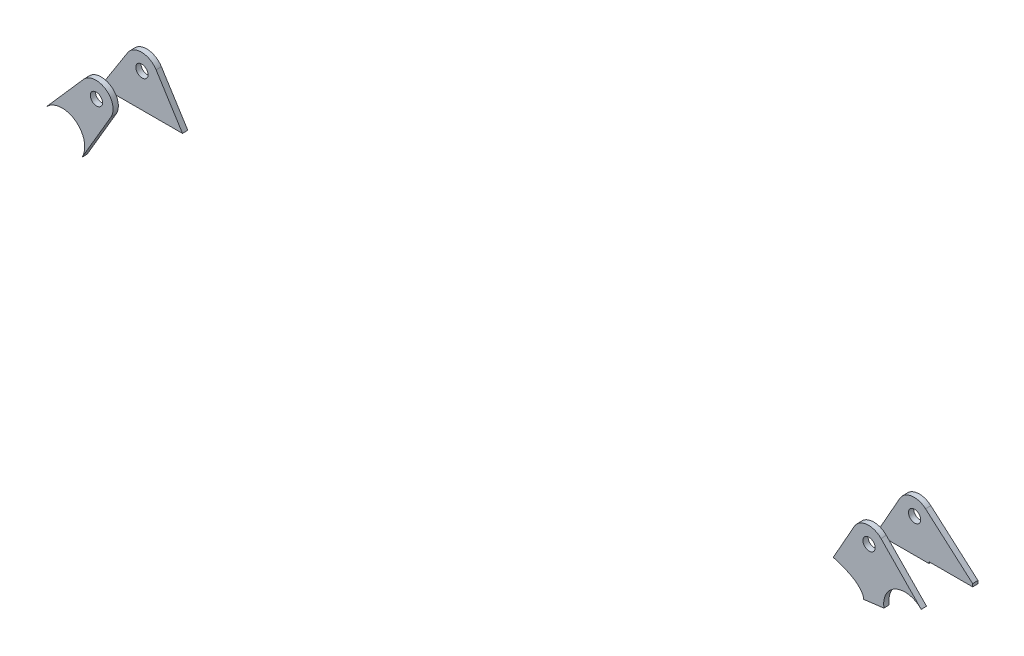
ISO-10303-21;
HEADER;
FILE_DESCRIPTION(('STEP AP214'),'2;1');
FILE_NAME('part.step','',(''),(''),'','','');
FILE_SCHEMA(('AUTOMOTIVE_DESIGN { 1 0 10303 214 1 1 1 1 }'));
ENDSEC;
DATA;
#1=APPLICATION_CONTEXT('core data for automotive mechanical design processes');
#2=APPLICATION_PROTOCOL_DEFINITION('international standard','automotive_design',2000,#1);
#3=PRODUCT_CONTEXT('',#1,'mechanical');
#4=PRODUCT('Part','Part','',(#3));
#5=PRODUCT_RELATED_PRODUCT_CATEGORY('part','',(#4));
#6=PRODUCT_DEFINITION_FORMATION('','',#4);
#7=PRODUCT_DEFINITION_CONTEXT('part definition',#1,'design');
#8=PRODUCT_DEFINITION('design','',#6,#7);
#9=PRODUCT_DEFINITION_SHAPE('','',#8);
#10=(LENGTH_UNIT() NAMED_UNIT(*) SI_UNIT(.MILLI.,.METRE.));
#11=(NAMED_UNIT(*) PLANE_ANGLE_UNIT() SI_UNIT($,.RADIAN.));
#12=(NAMED_UNIT(*) SI_UNIT($,.STERADIAN.) SOLID_ANGLE_UNIT());
#13=UNCERTAINTY_MEASURE_WITH_UNIT(LENGTH_MEASURE(1.E-05),#10,'distance_accuracy_value','');
#14=(GEOMETRIC_REPRESENTATION_CONTEXT(3) GLOBAL_UNCERTAINTY_ASSIGNED_CONTEXT((#13)) GLOBAL_UNIT_ASSIGNED_CONTEXT((#10,
#11,#12)) REPRESENTATION_CONTEXT('',''));
#15=CARTESIAN_POINT('',(0.,0.,0.));
#16=DIRECTION('',(0.,0.,1.));
#17=DIRECTION('',(1.,0.,0.));
#18=AXIS2_PLACEMENT_3D('',#15,#16,#17);
#19=CARTESIAN_POINT('',(-91.2738670795546,-55.8010311842299,94.258605063489));
#20=DIRECTION('',(0.866024919322855,0.499773154302078,0.0150875230171749));
#21=DIRECTION('',(-0.499830046534065,0.866123504231212,0.));
#22=AXIS2_PLACEMENT_3D('',#19,#20,#21);
#23=PLANE('',#22);
#24=DIRECTION('',(0.499999720295997,-0.865564787044811,-0.0282467543621517));
#25=VECTOR('',#24,1.);
#26=CARTESIAN_POINT('',(-91.2770403021915,-55.7050127328614,91.2601437267939));
#27=LINE('',#26,#25);
#28=CARTESIAN_POINT('',(-251.786513505118,222.157838688974,100.327892124088));
#29=VERTEX_POINT('',#28);
#30=CARTESIAN_POINT('',(-237.537473877372,197.49089098812,99.5229134292533));
#31=VERTEX_POINT('',#30);
#32=EDGE_CURVE('E118',#29,#31,#27,.T.);
#33=ORIENTED_EDGE('',*,*,#32,.F.);
#34=DIRECTION('',(-0.00105774087897386,0.0320061504561618,-0.999487112231674));
#35=VECTOR('',#34,1.);
#36=CARTESIAN_POINT('',(-251.783340282481,222.061820237606,103.326353460783));
#37=LINE('',#36,#35);
#38=CARTESIAN_POINT('',(-251.783340282481,222.061820237606,103.326353460783));
#39=VERTEX_POINT('',#38);
#40=EDGE_CURVE('E12',#39,#29,#37,.T.);
#41=ORIENTED_EDGE('',*,*,#40,.F.);
#42=DIRECTION('',(0.499999720295997,-0.865564787044811,-0.0282467543621517));
#43=VECTOR('',#42,1.);
#44=CARTESIAN_POINT('',(-91.2738670795546,-55.8010311842299,94.258605063489));
#45=LINE('',#44,#43);
#46=CARTESIAN_POINT('',(-237.534300654735,197.394872536751,102.521374765948));
#47=VERTEX_POINT('',#46);
#48=EDGE_CURVE('E102',#39,#47,#45,.T.);
#49=ORIENTED_EDGE('',*,*,#48,.T.);
#50=DIRECTION('',(-0.00105774087897386,0.0320061504561618,-0.999487112231674));
#51=VECTOR('',#50,1.);
#52=CARTESIAN_POINT('',(-237.534300654735,197.394872536751,102.521374765948));
#53=LINE('',#52,#51);
#54=EDGE_CURVE('E64',#47,#31,#53,.T.);
#55=ORIENTED_EDGE('',*,*,#54,.T.);
#56=EDGE_LOOP('',(#33,#41,#49,#55));
#57=FACE_BOUND('',#56,.T.);
#58=ADVANCED_FACE('F47',(#57),#23,.T.);
#59=CARTESIAN_POINT('',(-260.010577016049,217.313975271736,103.18302199212));
#60=DIRECTION('',(-0.00105774087897386,0.0320061504561618,-0.999487112231674));
#61=DIRECTION('',(0.,0.999487671353113,0.0320061683606697));
#62=AXIS2_PLACEMENT_3D('',#59,#60,#61);
#63=CYLINDRICAL_SURFACE('',#62,9.50000000000002);
#64=CARTESIAN_POINT('',(-260.013750238686,217.409993723105,100.184560655425));
#65=DIRECTION('',(0.00105774087897385,-0.0320061504561618,0.999487112231674));
#66=DIRECTION('',(0.,-0.999487671353113,-0.0320061683606697));
#67=AXIS2_PLACEMENT_3D('',#64,#65,#66);
#68=CIRCLE('',#67,9.50000000000002);
#69=CARTESIAN_POINT('',(-267.980359347288,222.582308660358,100.358622427788));
#70=VERTEX_POINT('',#69);
#71=EDGE_CURVE('E107',#29,#70,#68,.T.);
#72=ORIENTED_EDGE('',*,*,#71,.T.);
#73=DIRECTION('',(-0.00105774087897386,0.0320061504561618,-0.999487112231674));
#74=VECTOR('',#73,1.);
#75=CARTESIAN_POINT('',(-267.977186124651,222.486290208989,103.357083764483));
#76=LINE('',#75,#74);
#77=CARTESIAN_POINT('',(-267.977186124651,222.486290208989,103.357083764483));
#78=VERTEX_POINT('',#77);
#79=EDGE_CURVE('E56',#78,#70,#76,.T.);
#80=ORIENTED_EDGE('',*,*,#79,.F.);
#81=CARTESIAN_POINT('',(-260.010577016049,217.313975271736,103.18302199212));
#82=DIRECTION('',(0.00105774087897385,-0.0320061504561618,0.999487112231674));
#83=DIRECTION('',(0.,-0.999487671353113,-0.0320061683606697));
#84=AXIS2_PLACEMENT_3D('',#81,#82,#83);
#85=CIRCLE('',#84,9.50000000000002);
#86=EDGE_CURVE('E98',#39,#78,#85,.T.);
#87=ORIENTED_EDGE('',*,*,#86,.F.);
#88=ORIENTED_EDGE('',*,*,#40,.T.);
#89=EDGE_LOOP('',(#72,#80,#87,#88));
#90=FACE_BOUND('',#89,.T.);
#91=ADVANCED_FACE('F105',(#90),#63,.T.);
#92=CARTESIAN_POINT('',(-291.518754077939,186.264808466527,102.222092325642));
#93=DIRECTION('',(0.838590432484473,-0.544454203921399,-0.0183222918277194));
#94=DIRECTION('',(0.544545615311927,0.838731228013215,0.));
#95=AXIS2_PLACEMENT_3D('',#92,#93,#94);
#96=PLANE('',#95);
#97=DIRECTION('',(-0.544761386048734,-0.838179709946079,-0.026264160084979));
#98=VECTOR('',#97,1.);
#99=CARTESIAN_POINT('',(-291.521927300576,186.360826917896,99.2236309889469));
#100=LINE('',#99,#98);
#101=CARTESIAN_POINT('',(-284.286956001345,197.492684462062,99.5724450739382));
#102=VERTEX_POINT('',#101);
#103=EDGE_CURVE('E115',#70,#102,#100,.T.);
#104=ORIENTED_EDGE('',*,*,#103,.T.);
#105=DIRECTION('',(-0.00105774087897386,0.0320061504561618,-0.999487112231674));
#106=VECTOR('',#105,1.);
#107=CARTESIAN_POINT('',(-284.283782778708,197.396666010694,102.570906410633));
#108=LINE('',#107,#106);
#109=CARTESIAN_POINT('',(-284.283782778708,197.396666010694,102.570906410633));
#110=VERTEX_POINT('',#109);
#111=EDGE_CURVE('E78',#110,#102,#108,.T.);
#112=ORIENTED_EDGE('',*,*,#111,.F.);
#113=DIRECTION('',(-0.544761386048734,-0.838179709946079,-0.026264160084979));
#114=VECTOR('',#113,1.);
#115=CARTESIAN_POINT('',(-291.518754077939,186.264808466527,102.222092325642));
#116=LINE('',#115,#114);
#117=EDGE_CURVE('E90',#78,#110,#116,.T.);
#118=ORIENTED_EDGE('',*,*,#117,.F.);
#119=ORIENTED_EDGE('',*,*,#79,.T.);
#120=EDGE_LOOP('',(#104,#112,#118,#119));
#121=FACE_BOUND('',#120,.T.);
#122=ADVANCED_FACE('F92',(#121),#96,.F.);
#123=CARTESIAN_POINT('',(-260.010577016049,217.313975271736,103.18302199212));
#124=DIRECTION('',(-0.00105774087897386,0.0320061504561618,-0.999487112231674));
#125=DIRECTION('',(0.,0.999487671353113,0.0320061683606697));
#126=AXIS2_PLACEMENT_3D('',#123,#124,#125);
#127=CYLINDRICAL_SURFACE('',#126,3.5);
#128=CARTESIAN_POINT('',(-260.010577016049,217.313975271736,103.18302199212));
#129=DIRECTION('',(0.00105774087897385,-0.0320061504561618,0.999487112231674));
#130=DIRECTION('',(0.,-0.999487671353113,-0.0320061683606697));
#131=AXIS2_PLACEMENT_3D('',#128,#129,#130);
#132=CIRCLE('',#131,3.5);
#133=CARTESIAN_POINT('',(-260.010577016049,213.815768422,103.071000402857));
#134=VERTEX_POINT('',#133);
#135=EDGE_CURVE('E114',#134,#134,#132,.T.);
#136=ORIENTED_EDGE('',*,*,#135,.T.);
#137=EDGE_LOOP('',(#136));
#138=FACE_BOUND('',#137,.T.);
#139=CARTESIAN_POINT('',(-260.013750238686,217.409993723105,100.184560655425));
#140=DIRECTION('',(0.00105774087897385,-0.0320061504561618,0.999487112231674));
#141=DIRECTION('',(0.,-0.999487671353113,-0.0320061683606697));
#142=AXIS2_PLACEMENT_3D('',#139,#140,#141);
#143=CIRCLE('',#142,3.5);
#144=CARTESIAN_POINT('',(-260.013750238686,213.911786873369,100.072539066162));
#145=VERTEX_POINT('',#144);
#146=EDGE_CURVE('E120',#145,#145,#143,.T.);
#147=ORIENTED_EDGE('',*,*,#146,.F.);
#148=EDGE_LOOP('',(#147));
#149=FACE_BOUND('',#148,.T.);
#150=ADVANCED_FACE('F49',(#138,#149),#127,.F.);
#151=CARTESIAN_POINT('',(0.115928274146804,197.385755441254,102.269581459075));
#152=DIRECTION('',(-7.22546927104146E-05,-0.999487671190206,-0.0320060918894924));
#153=DIRECTION('',(0.,0.0320060919730401,-0.999487673799239));
#154=AXIS2_PLACEMENT_3D('',#151,#152,#153);
#155=PLANE('',#154);
#156=DIRECTION('',(-0.999999437981588,3.83634823946099E-05,0.00105951156241431));
#157=VECTOR('',#156,1.);
#158=CARTESIAN_POINT('',(0.112755051509882,197.481773892622,99.2711201223803));
#159=LINE('',#158,#157);
#160=EDGE_CURVE('E111',#31,#102,#159,.T.);
#161=ORIENTED_EDGE('',*,*,#160,.F.);
#162=ORIENTED_EDGE('',*,*,#54,.F.);
#163=DIRECTION('',(-0.999999437981588,3.83634823946099E-05,0.00105951156241431));
#164=VECTOR('',#163,1.);
#165=CARTESIAN_POINT('',(0.115928274146804,197.385755441254,102.269581459075));
#166=LINE('',#165,#164);
#167=EDGE_CURVE('E97',#47,#110,#166,.T.);
#168=ORIENTED_EDGE('',*,*,#167,.T.);
#169=ORIENTED_EDGE('',*,*,#111,.T.);
#170=EDGE_LOOP('',(#161,#162,#168,#169));
#171=FACE_BOUND('',#170,.T.);
#172=ADVANCED_FACE('F132',(#171),#155,.T.);
#173=CARTESIAN_POINT('',(0.101437025648791,-3.06938000532834,95.8505072976263));
#174=DIRECTION('',(0.00105774087897385,-0.0320061504561618,0.999487112231674));
#175=DIRECTION('',(0.,-0.999487671353113,-0.0320061683606697));
#176=AXIS2_PLACEMENT_3D('',#173,#174,#175);
#177=PLANE('',#176);
#178=ORIENTED_EDGE('',*,*,#135,.F.);
#179=EDGE_LOOP('',(#178));
#180=FACE_BOUND('',#179,.T.);
#181=ORIENTED_EDGE('',*,*,#48,.F.);
#182=ORIENTED_EDGE('',*,*,#86,.T.);
#183=ORIENTED_EDGE('',*,*,#117,.T.);
#184=ORIENTED_EDGE('',*,*,#167,.F.);
#185=EDGE_LOOP('',(#181,#182,#183,#184));
#186=FACE_BOUND('',#185,.T.);
#187=ADVANCED_FACE('F101',(#180,#186),#177,.T.);
#188=CARTESIAN_POINT('',(0.0982638030118695,-2.97336155395985,92.8520459609312));
#189=DIRECTION('',(0.00105774087897385,-0.0320061504561618,0.999487112231674));
#190=DIRECTION('',(0.,-0.999487671353113,-0.0320061683606697));
#191=AXIS2_PLACEMENT_3D('',#188,#189,#190);
#192=PLANE('',#191);
#193=ORIENTED_EDGE('',*,*,#146,.T.);
#194=EDGE_LOOP('',(#193));
#195=FACE_BOUND('',#194,.T.);
#196=ORIENTED_EDGE('',*,*,#32,.T.);
#197=ORIENTED_EDGE('',*,*,#160,.T.);
#198=ORIENTED_EDGE('',*,*,#103,.F.);
#199=ORIENTED_EDGE('',*,*,#71,.F.);
#200=EDGE_LOOP('',(#196,#197,#198,#199));
#201=FACE_BOUND('',#200,.T.);
#202=ADVANCED_FACE('F131',(#195,#201),#192,.F.);
#203=CLOSED_SHELL('',(#58,#91,#122,#150,#172,#187,#202));
#204=MANIFOLD_SOLID_BREP('B2',#203);
#205=CARTESIAN_POINT('',(212.513005449773,199.961143919961,102.127275672207));
#206=DIRECTION('',(0.99999943730061,-4.72380598829465E-05,-0.00105979574851192));
#207=DIRECTION('',(-0.00105979574969435,0.,-0.999999438416327));
#208=AXIS2_PLACEMENT_3D('',#205,#206,#207);
#209=PLANE('',#208);
#210=CARTESIAN_POINT('',(212.509832227137,200.05716237133,99.1288143355122));
#211=DIRECTION('',(-8.11338142395073E-05,-0.999487670810172,-0.0320060824806945));
#212=VECTOR('',#211,1.);
#213=LINE('',#210,#212);
#214=CARTESIAN_POINT('',(212.509832227137,200.05716237133,99.1288143355122));
#215=VERTEX_POINT('',#214);
#216=CARTESIAN_POINT('',(212.509697306726,198.395077489638,99.0755902414419));
#217=VERTEX_POINT('',#216);
#218=EDGE_CURVE('E303',#215,#217,#213,.T.);
#219=ORIENTED_EDGE('',*,*,#218,.F.);
#220=CARTESIAN_POINT('',(212.513005449774,199.961143919961,102.127275672207));
#221=DIRECTION('',(-0.00105774087897729,0.0320061504561578,-0.999487112231674));
#222=VECTOR('',#221,1.);
#223=LINE('',#220,#222);
#224=CARTESIAN_POINT('',(212.513005449774,199.961143919961,102.127275672207));
#225=VERTEX_POINT('',#224);
#226=EDGE_CURVE('E45',#225,#215,#223,.T.);
#227=ORIENTED_EDGE('',*,*,#226,.F.);
#228=CARTESIAN_POINT('',(212.513005449773,199.961143919961,102.127275672207));
#229=DIRECTION('',(-8.11338142395073E-05,-0.999487670810172,-0.0320060824806945));
#230=VECTOR('',#229,1.);
#231=LINE('',#228,#230);
#232=CARTESIAN_POINT('',(212.512870529363,198.29905903827,102.074051578137));
#233=VERTEX_POINT('',#232);
#234=EDGE_CURVE('E393',#225,#233,#231,.T.);
#235=ORIENTED_EDGE('',*,*,#234,.T.);
#236=CARTESIAN_POINT('',(212.512870529364,198.29905903827,102.074051578137));
#237=DIRECTION('',(-0.00105774087897729,0.0320061504561578,-0.999487112231674));
#238=VECTOR('',#237,1.);
#239=LINE('',#236,#238);
#240=EDGE_CURVE('E220',#233,#217,#239,.T.);
#241=ORIENTED_EDGE('',*,*,#240,.T.);
#242=EDGE_LOOP('',(#219,#227,#235,#241));
#243=FACE_BOUND('',#242,.T.);
#244=ADVANCED_FACE('F201',(#243),#209,.T.);
#245=CARTESIAN_POINT('',(200.398592231556,211.270244285348,102.502242666096));
#246=DIRECTION('',(0.682592365409432,0.730447674082727,0.0226684386733988));
#247=DIRECTION('',(-0.730635419673092,0.682767810839912,0.));
#248=AXIS2_PLACEMENT_3D('',#245,#246,#247);
#249=PLANE('',#248);
#250=DIRECTION('',(0.730798565864075,-0.682218294800214,-0.0226197783123503));
#251=VECTOR('',#250,1.);
#252=CARTESIAN_POINT('',(200.395419008919,211.366262736717,99.503781329401));
#253=LINE('',#252,#251);
#254=CARTESIAN_POINT('',(186.470877203989,224.365162310091,99.9347756737264));
#255=VERTEX_POINT('',#254);
#256=EDGE_CURVE('E308',#255,#215,#253,.T.);
#257=ORIENTED_EDGE('',*,*,#256,.F.);
#258=DIRECTION('',(-0.00105774087897386,0.0320061504561618,-0.999487112231674));
#259=VECTOR('',#258,1.);
#260=CARTESIAN_POINT('',(186.474050426626,224.269143858723,102.933237010421));
#261=LINE('',#260,#259);
#262=CARTESIAN_POINT('',(186.474050426626,224.269143858723,102.933237010421));
#263=VERTEX_POINT('',#262);
#264=EDGE_CURVE('E212',#263,#255,#261,.T.);
#265=ORIENTED_EDGE('',*,*,#264,.F.);
#266=DIRECTION('',(0.730798565864075,-0.682218294800214,-0.0226197783123503));
#267=VECTOR('',#266,1.);
#268=CARTESIAN_POINT('',(200.398592231556,211.270244285348,102.502242666096));
#269=LINE('',#268,#267);
#270=EDGE_CURVE('E408',#263,#225,#269,.T.);
#271=ORIENTED_EDGE('',*,*,#270,.T.);
#272=ORIENTED_EDGE('',*,*,#226,.T.);
#273=EDGE_LOOP('',(#257,#265,#271,#272));
#274=FACE_BOUND('',#273,.T.);
#275=ADVANCED_FACE('F347',(#274),#249,.T.);
#276=CARTESIAN_POINT('',(179.989422955237,217.329890954937,102.717886843024));
#277=DIRECTION('',(-0.00105774087897386,0.0320061504561618,-0.999487112231674));
#278=DIRECTION('',(0.,0.999487671353113,0.0320061683606697));
#279=AXIS2_PLACEMENT_3D('',#276,#277,#278);
#280=CYLINDRICAL_SURFACE('',#279,9.5);
#281=CARTESIAN_POINT('',(179.9862497326,217.425909406305,99.7194255063291));
#282=DIRECTION('',(0.00105774087897385,-0.0320061504561618,0.999487112231674));
#283=DIRECTION('',(0.,-0.999487671353113,-0.0320061683606697));
#284=AXIS2_PLACEMENT_3D('',#281,#282,#283);
#285=CIRCLE('',#284,9.5);
#286=CARTESIAN_POINT('',(171.759012999033,222.17319731829,99.8801526370923));
#287=VERTEX_POINT('',#286);
#288=EDGE_CURVE('E374',#255,#287,#285,.T.);
#289=ORIENTED_EDGE('',*,*,#288,.T.);
#290=DIRECTION('',(-0.00105774087897386,0.0320061504561618,-0.999487112231674));
#291=VECTOR('',#290,1.);
#292=CARTESIAN_POINT('',(171.76218622167,222.077178866922,102.878613973787));
#293=LINE('',#292,#291);
#294=CARTESIAN_POINT('',(171.76218622167,222.077178866922,102.878613973787));
#295=VERTEX_POINT('',#294);
#296=EDGE_CURVE('E396',#295,#287,#293,.T.);
#297=ORIENTED_EDGE('',*,*,#296,.F.);
#298=CARTESIAN_POINT('',(179.989422955237,217.329890954937,102.717886843024));
#299=DIRECTION('',(0.00105774087897385,-0.0320061504561618,0.999487112231674));
#300=DIRECTION('',(0.,-0.999487671353113,-0.0320061683606697));
#301=AXIS2_PLACEMENT_3D('',#298,#299,#300);
#302=CIRCLE('',#301,9.5);
#303=EDGE_CURVE('E406',#263,#295,#302,.T.);
#304=ORIENTED_EDGE('',*,*,#303,.F.);
#305=ORIENTED_EDGE('',*,*,#264,.T.);
#306=EDGE_LOOP('',(#289,#297,#304,#305));
#307=FACE_BOUND('',#306,.T.);
#308=ADVANCED_FACE('F356',(#307),#280,.T.);
#309=CARTESIAN_POINT('',(31.3082782289013,-21.0763809964377,95.2408510777782));
#310=DIRECTION('',(0.866024919322865,-0.499714517051052,-0.0169186453434954));
#311=DIRECTION('',(0.49978605169017,0.866148891666987,0.));
#312=AXIS2_PLACEMENT_3D('',#309,#310,#311);
#313=PLANE('',#312);
#314=DIRECTION('',(-0.49999972029598,-0.865598641277475,-0.0271895553941314));
#315=VECTOR('',#314,1.);
#316=CARTESIAN_POINT('',(31.3051050062644,-20.9803625450692,92.2423897410831));
#317=LINE('',#316,#315);
#318=CARTESIAN_POINT('',(157.488389351472,197.467918618938,99.1041283786298));
#319=VERTEX_POINT('',#318);
#320=EDGE_CURVE('E375',#287,#319,#317,.T.);
#321=ORIENTED_EDGE('',*,*,#320,.T.);
#322=DIRECTION('',(-0.00105774087897386,0.0320061504561618,-0.999487112231674));
#323=VECTOR('',#322,1.);
#324=CARTESIAN_POINT('',(157.491562574109,197.371900167569,102.102589715325));
#325=LINE('',#324,#323);
#326=CARTESIAN_POINT('',(157.491562574109,197.371900167569,102.102589715325));
#327=VERTEX_POINT('',#326);
#328=EDGE_CURVE('E276',#327,#319,#325,.T.);
#329=ORIENTED_EDGE('',*,*,#328,.F.);
#330=DIRECTION('',(-0.49999972029598,-0.865598641277475,-0.0271895553941314));
#331=VECTOR('',#330,1.);
#332=CARTESIAN_POINT('',(31.3082782289013,-21.0763809964377,95.2408510777782));
#333=LINE('',#332,#331);
#334=EDGE_CURVE('E285',#295,#327,#333,.T.);
#335=ORIENTED_EDGE('',*,*,#334,.F.);
#336=ORIENTED_EDGE('',*,*,#296,.T.);
#337=EDGE_LOOP('',(#321,#329,#335,#336));
#338=FACE_BOUND('',#337,.T.);
#339=ADVANCED_FACE('F359',(#338),#313,.F.);
#340=CARTESIAN_POINT('',(0.101437025648837,197.366571842661,102.268982486713));
#341=DIRECTION('',(0.,-0.999487671353113,-0.0320061683606697));
#342=DIRECTION('',(0.,0.0320061683606697,-0.999487671353113));
#343=AXIS2_PLACEMENT_3D('',#340,#341,#342);
#344=PLANE('',#343);
#345=DIRECTION('',(-0.99999944059196,-3.38542326541699E-05,0.00105719896802057));
#346=VECTOR('',#345,1.);
#347=CARTESIAN_POINT('',(0.0982638030119157,197.462590294029,99.2705211500177));
#348=LINE('',#347,#346);
#349=CARTESIAN_POINT('',(187.49976835712,197.468934631713,99.0724003619673));
#350=VERTEX_POINT('',#349);
#351=EDGE_CURVE('E272',#350,#319,#348,.T.);
#352=ORIENTED_EDGE('',*,*,#351,.F.);
#353=DIRECTION('',(-0.00105774087897386,0.0320061504561618,-0.999487112231674));
#354=VECTOR('',#353,1.);
#355=CARTESIAN_POINT('',(187.502941579757,197.372916180345,102.070861698662));
#356=LINE('',#355,#354);
#357=CARTESIAN_POINT('',(187.502941579757,197.372916180345,102.070861698662));
#358=VERTEX_POINT('',#357);
#359=EDGE_CURVE('E267',#358,#350,#356,.T.);
#360=ORIENTED_EDGE('',*,*,#359,.F.);
#361=DIRECTION('',(-0.99999944059196,-3.38542326541699E-05,0.00105719896802057));
#362=VECTOR('',#361,1.);
#363=CARTESIAN_POINT('',(0.101437025648837,197.366571842661,102.268982486713));
#364=LINE('',#363,#362);
#365=EDGE_CURVE('E270',#358,#327,#364,.T.);
#366=ORIENTED_EDGE('',*,*,#365,.T.);
#367=ORIENTED_EDGE('',*,*,#328,.T.);
#368=EDGE_LOOP('',(#352,#360,#366,#367));
#369=FACE_BOUND('',#368,.T.);
#370=ADVANCED_FACE('F269',(#369),#344,.T.);
#371=CARTESIAN_POINT('',(187.502941579757,-3.06303566764431,95.6523865095758));
#372=DIRECTION('',(0.99999944059196,3.38542326544016E-05,-0.00105719896802058));
#373=DIRECTION('',(-0.00105719896862641,0.,-0.999999441165014));
#374=AXIS2_PLACEMENT_3D('',#371,#372,#373);
#375=PLANE('',#374);
#376=DIRECTION('',(0.,-0.999487671353113,-0.0320061683606697));
#377=VECTOR('',#376,1.);
#378=CARTESIAN_POINT('',(187.49976835712,-2.96701721627582,92.6539251728807));
#379=LINE('',#378,#377);
#380=CARTESIAN_POINT('',(187.49976835712,198.394230797211,99.1020307273087));
#381=VERTEX_POINT('',#380);
#382=EDGE_CURVE('E384',#381,#350,#379,.T.);
#383=ORIENTED_EDGE('',*,*,#382,.F.);
#384=DIRECTION('',(-0.00105774087897386,0.0320061504561618,-0.999487112231674));
#385=VECTOR('',#384,1.);
#386=CARTESIAN_POINT('',(187.502941579757,198.298212345843,102.100492064004));
#387=LINE('',#386,#385);
#388=CARTESIAN_POINT('',(187.502941579757,198.298212345843,102.100492064004));
#389=VERTEX_POINT('',#388);
#390=EDGE_CURVE('E243',#389,#381,#387,.T.);
#391=ORIENTED_EDGE('',*,*,#390,.F.);
#392=DIRECTION('',(0.,-0.999487671353113,-0.0320061683606697));
#393=VECTOR('',#392,1.);
#394=CARTESIAN_POINT('',(187.502941579757,-3.06303566764431,95.6523865095758));
#395=LINE('',#394,#393);
#396=EDGE_CURVE('E283',#389,#358,#395,.T.);
#397=ORIENTED_EDGE('',*,*,#396,.T.);
#398=ORIENTED_EDGE('',*,*,#359,.T.);
#399=EDGE_LOOP('',(#383,#391,#397,#398));
#400=FACE_BOUND('',#399,.T.);
#401=ADVANCED_FACE('F288',(#400),#375,.T.);
#402=CARTESIAN_POINT('',(0.101437025648797,198.291868008159,102.298612852054));
#403=DIRECTION('',(0.,-0.999487671353113,-0.0320061683606697));
#404=DIRECTION('',(0.,0.0320061683606697,-0.999487671353113));
#405=AXIS2_PLACEMENT_3D('',#402,#403,#404);
#406=PLANE('',#405);
#407=DIRECTION('',(-0.99999944059196,-3.38542326543703E-05,0.00105719896802057));
#408=VECTOR('',#407,1.);
#409=CARTESIAN_POINT('',(0.0982638030118755,198.387886459527,99.3001515153591));
#410=LINE('',#409,#408);
#411=EDGE_CURVE('E386',#217,#381,#410,.T.);
#412=ORIENTED_EDGE('',*,*,#411,.F.);
#413=ORIENTED_EDGE('',*,*,#240,.F.);
#414=DIRECTION('',(-0.99999944059196,-3.38542326543703E-05,0.00105719896802057));
#415=VECTOR('',#414,1.);
#416=CARTESIAN_POINT('',(0.101437025648797,198.291868008159,102.298612852054));
#417=LINE('',#416,#415);
#418=EDGE_CURVE('E289',#233,#389,#417,.T.);
#419=ORIENTED_EDGE('',*,*,#418,.T.);
#420=ORIENTED_EDGE('',*,*,#390,.T.);
#421=EDGE_LOOP('',(#412,#413,#419,#420));
#422=FACE_BOUND('',#421,.T.);
#423=ADVANCED_FACE('F324',(#422),#406,.T.);
#424=CARTESIAN_POINT('',(179.989422955237,217.329890954937,102.717886843024));
#425=DIRECTION('',(-0.00105774087897386,0.0320061504561618,-0.999487112231674));
#426=DIRECTION('',(0.,0.999487671353113,0.0320061683606697));
#427=AXIS2_PLACEMENT_3D('',#424,#425,#426);
#428=CYLINDRICAL_SURFACE('',#427,3.49999999999998);
#429=CARTESIAN_POINT('',(179.989422955237,217.329890954937,102.717886843024));
#430=DIRECTION('',(0.00105774087897385,-0.0320061504561618,0.999487112231674));
#431=DIRECTION('',(0.,-0.999487671353113,-0.0320061683606697));
#432=AXIS2_PLACEMENT_3D('',#429,#430,#431);
#433=CIRCLE('',#432,3.49999999999998);
#434=CARTESIAN_POINT('',(179.989422955237,213.831684105201,102.605865253762));
#435=VERTEX_POINT('',#434);
#436=EDGE_CURVE('E291',#435,#435,#433,.T.);
#437=ORIENTED_EDGE('',*,*,#436,.T.);
#438=EDGE_LOOP('',(#437));
#439=FACE_BOUND('',#438,.T.);
#440=CARTESIAN_POINT('',(179.9862497326,217.425909406305,99.7194255063291));
#441=DIRECTION('',(0.00105774087897385,-0.0320061504561618,0.999487112231674));
#442=DIRECTION('',(0.,-0.999487671353113,-0.0320061683606697));
#443=AXIS2_PLACEMENT_3D('',#440,#441,#442);
#444=CIRCLE('',#443,3.49999999999998);
#445=CARTESIAN_POINT('',(179.9862497326,213.927702556569,99.6074039170668));
#446=VERTEX_POINT('',#445);
#447=EDGE_CURVE('E388',#446,#446,#444,.T.);
#448=ORIENTED_EDGE('',*,*,#447,.F.);
#449=EDGE_LOOP('',(#448));
#450=FACE_BOUND('',#449,.T.);
#451=ADVANCED_FACE('F321',(#439,#450),#428,.F.);
#452=CARTESIAN_POINT('',(0.101437025648791,-3.06938000532834,95.8505072976263));
#453=DIRECTION('',(0.00105774087897385,-0.0320061504561618,0.999487112231674));
#454=DIRECTION('',(0.,-0.999487671353113,-0.0320061683606697));
#455=AXIS2_PLACEMENT_3D('',#452,#453,#454);
#456=PLANE('',#455);
#457=ORIENTED_EDGE('',*,*,#234,.F.);
#458=ORIENTED_EDGE('',*,*,#270,.F.);
#459=ORIENTED_EDGE('',*,*,#303,.T.);
#460=ORIENTED_EDGE('',*,*,#334,.T.);
#461=ORIENTED_EDGE('',*,*,#365,.F.);
#462=ORIENTED_EDGE('',*,*,#396,.F.);
#463=ORIENTED_EDGE('',*,*,#418,.F.);
#464=EDGE_LOOP('',(#457,#458,#459,#460,#461,#462,#463));
#465=FACE_BOUND('',#464,.T.);
#466=ORIENTED_EDGE('',*,*,#436,.F.);
#467=EDGE_LOOP('',(#466));
#468=FACE_BOUND('',#467,.T.);
#469=ADVANCED_FACE('F280',(#465,#468),#456,.T.);
#470=CARTESIAN_POINT('',(0.0982638030118695,-2.97336155395985,92.8520459609312));
#471=DIRECTION('',(0.00105774087897385,-0.0320061504561618,0.999487112231674));
#472=DIRECTION('',(0.,-0.999487671353113,-0.0320061683606697));
#473=AXIS2_PLACEMENT_3D('',#470,#471,#472);
#474=PLANE('',#473);
#475=ORIENTED_EDGE('',*,*,#218,.T.);
#476=ORIENTED_EDGE('',*,*,#411,.T.);
#477=ORIENTED_EDGE('',*,*,#382,.T.);
#478=ORIENTED_EDGE('',*,*,#351,.T.);
#479=ORIENTED_EDGE('',*,*,#320,.F.);
#480=ORIENTED_EDGE('',*,*,#288,.F.);
#481=ORIENTED_EDGE('',*,*,#256,.T.);
#482=EDGE_LOOP('',(#475,#476,#477,#478,#479,#480,#481));
#483=FACE_BOUND('',#482,.T.);
#484=ORIENTED_EDGE('',*,*,#447,.T.);
#485=EDGE_LOOP('',(#484));
#486=FACE_BOUND('',#485,.T.);
#487=ADVANCED_FACE('F310',(#483,#486),#474,.F.);
#488=CLOSED_SHELL('',(#244,#275,#308,#339,#370,#401,#423,#451,#469,#487));
#489=MANIFOLD_SOLID_BREP('B6',#488);
#490=CARTESIAN_POINT('',(31.3357794917545,-21.9085409082978,121.227515995802));
#491=DIRECTION('',(0.866024919322865,-0.499714517051053,-0.0169186453434954));
#492=DIRECTION('',(0.499786051690171,0.866148891666987,0.));
#493=AXIS2_PLACEMENT_3D('',#490,#491,#492);
#494=PLANE('',#493);
#495=DIRECTION('',(-0.499999720295981,-0.865598641277475,-0.0271895553941314));
#496=VECTOR('',#495,1.);
#497=CARTESIAN_POINT('',(31.3326062691176,-21.8125224569294,118.229054659107));
#498=LINE('',#497,#496);
#499=CARTESIAN_POINT('',(171.786514261886,221.34103740643,125.866817555116));
#500=VERTEX_POINT('',#499);
#501=CARTESIAN_POINT('',(159.093199065056,199.366392338271,125.176565975625));
#502=VERTEX_POINT('',#501);
#503=EDGE_CURVE('E606',#500,#502,#498,.T.);
#504=ORIENTED_EDGE('',*,*,#503,.T.);
#505=DIRECTION('',(-0.00105774087897386,0.0320061504561618,-0.999487112231674));
#506=VECTOR('',#505,1.);
#507=CARTESIAN_POINT('',(159.096372287693,199.270373886903,128.17502731232));
#508=LINE('',#507,#506);
#509=CARTESIAN_POINT('',(159.096372287693,199.270373886903,128.17502731232));
#510=VERTEX_POINT('',#509);
#511=EDGE_CURVE('E199',#510,#502,#508,.T.);
#512=ORIENTED_EDGE('',*,*,#511,.F.);
#513=DIRECTION('',(-0.499999720295981,-0.865598641277475,-0.0271895553941314));
#514=VECTOR('',#513,1.);
#515=CARTESIAN_POINT('',(31.3357794917545,-21.9085409082978,121.227515995802));
#516=LINE('',#515,#514);
#517=CARTESIAN_POINT('',(171.789687484523,221.245018955062,128.865278891811));
#518=VERTEX_POINT('',#517);
#519=EDGE_CURVE('E640',#518,#510,#516,.T.);
#520=ORIENTED_EDGE('',*,*,#519,.F.);
#521=DIRECTION('',(-0.00105774087897386,0.0320061504561618,-0.999487112231674));
#522=VECTOR('',#521,1.);
#523=CARTESIAN_POINT('',(171.789687484523,221.245018955062,128.865278891811));
#524=LINE('',#523,#522);
#525=EDGE_CURVE('E596',#518,#500,#524,.T.);
#526=ORIENTED_EDGE('',*,*,#525,.T.);
#527=EDGE_LOOP('',(#504,#512,#520,#526));
#528=FACE_BOUND('',#527,.T.);
#529=ADVANCED_FACE('F516',(#528),#494,.F.);
#530=CARTESIAN_POINT('',(175.952773054176,186.291515358937,127.741571995431));
#531=CARTESIAN_POINT('',(173.699655307852,161.405933091491,126.947056022411));
#532=CARTESIAN_POINT('',(113.30959982793,166.865970560805,127.185810287657));
#533=CARTESIAN_POINT('',(115.562717574254,191.751552828251,127.980326260677));
#534=CARTESIAN_POINT('',(117.815835320579,216.637135095697,128.774842233697));
#535=CARTESIAN_POINT('',(178.2058908005,211.177097626383,128.536087968451));
#536=CARTESIAN_POINT('',(175.952773054176,186.291515358937,127.741571995431));
#537=(BOUNDED_CURVE() B_SPLINE_CURVE(3,(#530,#531,#532,#533,#534,#535,#536),.UNSPECIFIED.,.T.,
.F.) B_SPLINE_CURVE_WITH_KNOTS((4,3,4),(0.,0.5,1.),
.UNSPECIFIED.) CURVE() GEOMETRIC_REPRESENTATION_ITEM() RATIONAL_B_SPLINE_CURVE((1.,
0.333333333333333,0.333333333333333,1.,0.333333333333333,0.333333333333333,1.)) REPRESENTATION_ITEM(''));
#538=DIRECTION('',(-0.00105774087897386,0.0320061504561618,-0.999487112231674));
#539=VECTOR('',#538,1.);
#540=SURFACE_OF_LINEAR_EXTRUSION('',#537,#539);
#541=CARTESIAN_POINT('',(175.949599831539,186.387533810306,124.743110658736));
#542=CARTESIAN_POINT('',(173.696482085215,161.50195154286,123.948594685716));
#543=CARTESIAN_POINT('',(113.306426605293,166.961989012174,124.187348950962));
#544=CARTESIAN_POINT('',(115.559544351617,191.847571279619,124.981864923982));
#545=CARTESIAN_POINT('',(117.812662097942,216.733153547065,125.776380897002));
#546=CARTESIAN_POINT('',(178.202717577863,211.273116077751,125.537626631756));
#547=CARTESIAN_POINT('',(175.949599831539,186.387533810306,124.743110658736));
#548=(BOUNDED_CURVE() B_SPLINE_CURVE(3,(#541,#542,#543,#544,#545,#546,#547),.UNSPECIFIED.,.T.,
.F.) B_SPLINE_CURVE_WITH_KNOTS((4,3,4),(0.,0.5,1.),
.UNSPECIFIED.) CURVE() GEOMETRIC_REPRESENTATION_ITEM() RATIONAL_B_SPLINE_CURVE((1.,
0.333333333333333,0.333333333333333,1.,0.333333333333333,0.333333333333333,1.)) REPRESENTATION_ITEM(''));
#549=CARTESIAN_POINT('',(175.970607905858,186.854937525143,124.758055896488));
#550=VERTEX_POINT('',#549);
#551=EDGE_CURVE('E609',#502,#550,#548,.T.);
#552=ORIENTED_EDGE('',*,*,#551,.T.);
#553=DIRECTION('',(-0.00105774087897386,0.0320061504561618,-0.999487112231674));
#554=VECTOR('',#553,1.);
#555=CARTESIAN_POINT('',(175.973781128495,186.758919073774,127.756517233183));
#556=LINE('',#555,#554);
#557=CARTESIAN_POINT('',(175.973781128495,186.758919073774,127.756517233183));
#558=VERTEX_POINT('',#557);
#559=EDGE_CURVE('E525',#558,#550,#556,.T.);
#560=ORIENTED_EDGE('',*,*,#559,.F.);
#561=EDGE_CURVE('E566',#510,#558,#537,.T.);
#562=ORIENTED_EDGE('',*,*,#561,.F.);
#563=ORIENTED_EDGE('',*,*,#511,.T.);
#564=EDGE_LOOP('',(#552,#560,#562,#563));
#565=FACE_BOUND('',#564,.T.);
#566=ADVANCED_FACE('F654',(#565),#540,.F.);
#567=CARTESIAN_POINT('',(-21.055455201108,161.550678630234,127.157797298299));
#568=DIRECTION('',(-0.126937970643578,0.991398166352417,0.0318814579647086));
#569=DIRECTION('',(-0.991902392878657,-0.127002531477114,0.));
#570=AXIS2_PLACEMENT_3D('',#567,#568,#569);
#571=PLANE('',#570);
#572=DIRECTION('',(0.991910093099734,0.126906588032469,0.00301415341912751));
#573=VECTOR('',#572,1.);
#574=CARTESIAN_POINT('',(-21.0586284237449,161.646697081602,124.159335961604));
#575=LINE('',#574,#573);
#576=CARTESIAN_POINT('',(187.614897272938,188.344726815441,124.793439823774));
#577=VERTEX_POINT('',#576);
#578=EDGE_CURVE('E613',#550,#577,#575,.T.);
#579=ORIENTED_EDGE('',*,*,#578,.T.);
#580=DIRECTION('',(-0.00105774087897386,0.0320061504561618,-0.999487112231674));
#581=VECTOR('',#580,1.);
#582=CARTESIAN_POINT('',(187.618070495575,188.248708364073,127.791901160469));
#583=LINE('',#582,#581);
#584=CARTESIAN_POINT('',(187.618070495575,188.248708364073,127.791901160469));
#585=VERTEX_POINT('',#584);
#586=EDGE_CURVE('E592',#585,#577,#583,.T.);
#587=ORIENTED_EDGE('',*,*,#586,.F.);
#588=DIRECTION('',(0.991910093099734,0.126906588032469,0.00301415341912751));
#589=VECTOR('',#588,1.);
#590=CARTESIAN_POINT('',(-21.055455201108,161.550678630234,127.157797298299));
#591=LINE('',#590,#589);
#592=EDGE_CURVE('E579',#558,#585,#591,.T.);
#593=ORIENTED_EDGE('',*,*,#592,.F.);
#594=ORIENTED_EDGE('',*,*,#559,.T.);
#595=EDGE_LOOP('',(#579,#587,#593,#594));
#596=FACE_BOUND('',#595,.T.);
#597=ADVANCED_FACE('F633',(#596),#571,.F.);
#598=CARTESIAN_POINT('',(199.945161753014,202.632204326559,128.239452171428));
#599=CARTESIAN_POINT('',(224.944793517745,202.766070380673,128.217282205315));
#600=CARTESIAN_POINT('',(225.080482971431,177.290788474968,127.401354496104));
#601=CARTESIAN_POINT('',(200.0808512067,177.156922420854,127.423524462217));
#602=CARTESIAN_POINT('',(175.081219441968,177.023056366739,127.445694428329));
#603=CARTESIAN_POINT('',(174.945529988282,202.498338272444,128.26162213754));
#604=CARTESIAN_POINT('',(199.945161753014,202.632204326559,128.239452171428));
#605=(BOUNDED_CURVE() B_SPLINE_CURVE(3,(#598,#599,#600,#601,#602,#603,#604),.UNSPECIFIED.,.T.,
.F.) B_SPLINE_CURVE_WITH_KNOTS((4,3,4),(0.,0.5,1.),
.UNSPECIFIED.) CURVE() GEOMETRIC_REPRESENTATION_ITEM() RATIONAL_B_SPLINE_CURVE((1.,
0.333333333333333,0.333333333333333,1.,0.333333333333333,0.333333333333333,1.)) REPRESENTATION_ITEM(''));
#606=DIRECTION('',(-0.00105774087897386,0.0320061504561618,-0.999487112231674));
#607=VECTOR('',#606,1.);
#608=SURFACE_OF_LINEAR_EXTRUSION('',#605,#607);
#609=CARTESIAN_POINT('',(199.941988530377,202.728222777927,125.240990834733));
#610=CARTESIAN_POINT('',(224.941620295108,202.862088832042,125.21882086862));
#611=CARTESIAN_POINT('',(225.077309748794,177.386806926337,124.402893159409));
#612=CARTESIAN_POINT('',(200.077677984063,177.252940872222,124.425063125522));
#613=CARTESIAN_POINT('',(175.078046219332,177.119074818108,124.447233091634));
#614=CARTESIAN_POINT('',(174.942356765645,202.594356723813,125.263160800845));
#615=CARTESIAN_POINT('',(199.941988530377,202.728222777927,125.240990834733));
#616=(BOUNDED_CURVE() B_SPLINE_CURVE(3,(#609,#610,#611,#612,#613,#614,#615),.UNSPECIFIED.,.T.,
.F.) B_SPLINE_CURVE_WITH_KNOTS((4,3,4),(0.,0.5,1.),
.UNSPECIFIED.) CURVE() GEOMETRIC_REPRESENTATION_ITEM() RATIONAL_B_SPLINE_CURVE((1.,
0.333333333333333,0.333333333333333,1.,0.333333333333333,0.333333333333333,1.)) REPRESENTATION_ITEM(''));
#617=CARTESIAN_POINT('',(209.176521099773,198.648993445427,125.10059065484));
#618=VERTEX_POINT('',#617);
#619=EDGE_CURVE('E588',#577,#618,#616,.T.);
#620=ORIENTED_EDGE('',*,*,#619,.T.);
#621=DIRECTION('',(-0.00105774087897386,0.0320061504561618,-0.999487112231674));
#622=VECTOR('',#621,1.);
#623=CARTESIAN_POINT('',(209.17969432241,198.552974994058,128.099051991535));
#624=LINE('',#623,#622);
#625=CARTESIAN_POINT('',(209.17969432241,198.552974994058,128.099051991535));
#626=VERTEX_POINT('',#625);
#627=EDGE_CURVE('E585',#626,#618,#624,.T.);
#628=ORIENTED_EDGE('',*,*,#627,.F.);
#629=EDGE_CURVE('E573',#585,#626,#605,.T.);
#630=ORIENTED_EDGE('',*,*,#629,.F.);
#631=ORIENTED_EDGE('',*,*,#586,.T.);
#632=EDGE_LOOP('',(#620,#628,#630,#631));
#633=FACE_BOUND('',#632,.T.);
#634=ADVANCED_FACE('F586',(#633),#608,.F.);
#635=CARTESIAN_POINT('',(215.398638311723,191.716229328627,127.873540387712));
#636=DIRECTION('',(0.739920989240022,0.672373740092903,0.0207480918531833));
#637=DIRECTION('',(-0.672518509673709,0.740080302498488,0.));
#638=AXIS2_PLACEMENT_3D('',#635,#636,#637);
#639=PLANE('',#638);
#640=DIRECTION('',(0.672692954375397,-0.739519546710199,-0.024393219698133));
#641=VECTOR('',#640,1.);
#642=CARTESIAN_POINT('',(215.395465089086,191.812247779995,124.875079051017));
#643=LINE('',#642,#641);
#644=CARTESIAN_POINT('',(187.043000393233,222.981300025327,125.903197296958));
#645=VERTEX_POINT('',#644);
#646=EDGE_CURVE('E621',#645,#618,#643,.T.);
#647=ORIENTED_EDGE('',*,*,#646,.F.);
#648=DIRECTION('',(-0.00105774087897386,0.0320061504561618,-0.999487112231674));
#649=VECTOR('',#648,1.);
#650=CARTESIAN_POINT('',(187.04617361587,222.885281573959,128.901658633653));
#651=LINE('',#650,#649);
#652=CARTESIAN_POINT('',(187.04617361587,222.885281573959,128.901658633653));
#653=VERTEX_POINT('',#652);
#654=EDGE_CURVE('E555',#653,#645,#651,.T.);
#655=ORIENTED_EDGE('',*,*,#654,.F.);
#656=DIRECTION('',(0.672692954375397,-0.739519546710199,-0.024393219698133));
#657=VECTOR('',#656,1.);
#658=CARTESIAN_POINT('',(215.398638311723,191.716229328627,127.873540387712));
#659=LINE('',#658,#657);
#660=EDGE_CURVE('E577',#653,#626,#659,.T.);
#661=ORIENTED_EDGE('',*,*,#660,.T.);
#662=ORIENTED_EDGE('',*,*,#627,.T.);
#663=EDGE_LOOP('',(#647,#655,#661,#662));
#664=FACE_BOUND('',#663,.T.);
#665=ADVANCED_FACE('F594',(#664),#639,.T.);
#666=CARTESIAN_POINT('',(180.01692421809,216.497731043077,128.704551761048));
#667=DIRECTION('',(-0.00105774087897386,0.0320061504561618,-0.999487112231674));
#668=DIRECTION('',(0.,0.999487671353113,0.0320061683606697));
#669=AXIS2_PLACEMENT_3D('',#666,#667,#668);
#670=CYLINDRICAL_SURFACE('',#669,3.49999999999998);
#671=CARTESIAN_POINT('',(180.01692421809,216.497731043077,128.704551761048));
#672=DIRECTION('',(0.00105774087897388,-0.0320061504561618,0.999487112231674));
#673=DIRECTION('',(0.,-0.999487671353113,-0.0320061683606697));
#674=AXIS2_PLACEMENT_3D('',#671,#672,#673);
#675=CIRCLE('',#674,3.49999999999998);
#676=CARTESIAN_POINT('',(180.01692421809,212.999524193341,128.592530171785));
#677=VERTEX_POINT('',#676);
#678=EDGE_CURVE('E627',#677,#677,#675,.T.);
#679=ORIENTED_EDGE('',*,*,#678,.T.);
#680=EDGE_LOOP('',(#679));
#681=FACE_BOUND('',#680,.T.);
#682=CARTESIAN_POINT('',(180.013750995453,216.593749494445,125.706090424353));
#683=DIRECTION('',(0.00105774087897388,-0.0320061504561618,0.999487112231674));
#684=DIRECTION('',(0.,-0.999487671353113,-0.0320061683606697));
#685=AXIS2_PLACEMENT_3D('',#682,#683,#684);
#686=CIRCLE('',#685,3.49999999999998);
#687=CARTESIAN_POINT('',(180.013750995453,213.095542644709,125.59406883509));
#688=VERTEX_POINT('',#687);
#689=EDGE_CURVE('E603',#688,#688,#686,.T.);
#690=ORIENTED_EDGE('',*,*,#689,.F.);
#691=EDGE_LOOP('',(#690));
#692=FACE_BOUND('',#691,.T.);
#693=ADVANCED_FACE('F518',(#681,#692),#670,.F.);
#694=CARTESIAN_POINT('',(180.01692421809,216.497731043077,128.704551761048));
#695=DIRECTION('',(-0.00105774087897386,0.0320061504561618,-0.999487112231674));
#696=DIRECTION('',(0.,0.999487671353113,0.0320061683606697));
#697=AXIS2_PLACEMENT_3D('',#694,#695,#696);
#698=CYLINDRICAL_SURFACE('',#697,9.49999999999994);
#699=CARTESIAN_POINT('',(180.013750995453,216.593749494445,125.706090424353));
#700=DIRECTION('',(0.00105774087897388,-0.0320061504561618,0.999487112231674));
#701=DIRECTION('',(0.,-0.999487671353113,-0.0320061683606697));
#702=AXIS2_PLACEMENT_3D('',#699,#700,#701);
#703=CIRCLE('',#702,9.49999999999994);
#704=EDGE_CURVE('E558',#645,#500,#703,.T.);
#705=ORIENTED_EDGE('',*,*,#704,.T.);
#706=ORIENTED_EDGE('',*,*,#525,.F.);
#707=CARTESIAN_POINT('',(180.01692421809,216.497731043077,128.704551761048));
#708=DIRECTION('',(0.00105774087897388,-0.0320061504561618,0.999487112231674));
#709=DIRECTION('',(0.,-0.999487671353113,-0.0320061683606697));
#710=AXIS2_PLACEMENT_3D('',#707,#708,#709);
#711=CIRCLE('',#710,9.49999999999994);
#712=EDGE_CURVE('E533',#653,#518,#711,.T.);
#713=ORIENTED_EDGE('',*,*,#712,.F.);
#714=ORIENTED_EDGE('',*,*,#654,.T.);
#715=EDGE_LOOP('',(#705,#706,#713,#714));
#716=FACE_BOUND('',#715,.T.);
#717=ADVANCED_FACE('F641',(#716),#698,.T.);
#718=CARTESIAN_POINT('',(0.128938288502115,-3.90153991718854,121.83717221565));
#719=DIRECTION('',(0.00105774087897388,-0.0320061504561618,0.999487112231674));
#720=DIRECTION('',(0.,-0.999487671353113,-0.0320061683606697));
#721=AXIS2_PLACEMENT_3D('',#718,#719,#720);
#722=PLANE('',#721);
#723=ORIENTED_EDGE('',*,*,#678,.F.);
#724=EDGE_LOOP('',(#723));
#725=FACE_BOUND('',#724,.T.);
#726=ORIENTED_EDGE('',*,*,#519,.T.);
#727=ORIENTED_EDGE('',*,*,#561,.T.);
#728=ORIENTED_EDGE('',*,*,#592,.T.);
#729=ORIENTED_EDGE('',*,*,#629,.T.);
#730=ORIENTED_EDGE('',*,*,#660,.F.);
#731=ORIENTED_EDGE('',*,*,#712,.T.);
#732=EDGE_LOOP('',(#726,#727,#728,#729,#730,#731));
#733=FACE_BOUND('',#732,.T.);
#734=ADVANCED_FACE('F575',(#725,#733),#722,.T.);
#735=CARTESIAN_POINT('',(0.125765065865194,-3.80552146582006,118.838710878955));
#736=DIRECTION('',(0.00105774087897388,-0.0320061504561618,0.999487112231674));
#737=DIRECTION('',(0.,-0.999487671353113,-0.0320061683606697));
#738=AXIS2_PLACEMENT_3D('',#735,#736,#737);
#739=PLANE('',#738);
#740=ORIENTED_EDGE('',*,*,#689,.T.);
#741=EDGE_LOOP('',(#740));
#742=FACE_BOUND('',#741,.T.);
#743=ORIENTED_EDGE('',*,*,#503,.F.);
#744=ORIENTED_EDGE('',*,*,#704,.F.);
#745=ORIENTED_EDGE('',*,*,#646,.T.);
#746=ORIENTED_EDGE('',*,*,#619,.F.);
#747=ORIENTED_EDGE('',*,*,#578,.F.);
#748=ORIENTED_EDGE('',*,*,#551,.F.);
#749=EDGE_LOOP('',(#743,#744,#745,#746,#747,#748));
#750=FACE_BOUND('',#749,.T.);
#751=ADVANCED_FACE('F636',(#742,#750),#739,.F.);
#752=CLOSED_SHELL('',(#529,#566,#597,#634,#665,#693,#717,#734,#751));
#753=MANIFOLD_SOLID_BREP('B39',#752);
#754=CARTESIAN_POINT('',(-262.720715394916,227.735422598384,129.532953584989));
#755=DIRECTION('',(0.750066300098574,-0.660997939336789,-0.0219606386281181));
#756=DIRECTION('',(0.661157386633633,0.750247232650534,0.));
#757=AXIS2_PLACEMENT_3D('',#754,#755,#756);
#758=PLANE('',#757);
#759=DIRECTION('',(-0.661361797082859,-0.749704828933025,-0.0233075703116975));
#760=VECTOR('',#759,1.);
#761=CARTESIAN_POINT('',(-262.723888617553,227.831441049753,126.534492248294));
#762=LINE('',#761,#760);
#763=CARTESIAN_POINT('',(-267.111878826769,222.857314234944,126.379851640415));
#764=VERTEX_POINT('',#763);
#765=CARTESIAN_POINT('',(-289.296691276673,197.709110791643,125.598019248057));
#766=VERTEX_POINT('',#765);
#767=EDGE_CURVE('E803',#764,#766,#762,.T.);
#768=ORIENTED_EDGE('',*,*,#767,.T.);
#769=DIRECTION('',(-0.00105774087897386,0.0320061504561618,-0.999487112231674));
#770=VECTOR('',#769,1.);
#771=CARTESIAN_POINT('',(-289.293518054036,197.613092340275,128.596480584752));
#772=LINE('',#771,#770);
#773=CARTESIAN_POINT('',(-289.293518054036,197.613092340275,128.596480584752));
#774=VERTEX_POINT('',#773);
#775=EDGE_CURVE('E514',#774,#766,#772,.T.);
#776=ORIENTED_EDGE('',*,*,#775,.F.);
#777=DIRECTION('',(-0.661361797082859,-0.749704828933025,-0.0233075703116975));
#778=VECTOR('',#777,1.);
#779=CARTESIAN_POINT('',(-262.720715394916,227.735422598384,129.532953584989));
#780=LINE('',#779,#778);
#781=CARTESIAN_POINT('',(-267.108705604132,222.761295783575,129.37831297711));
#782=VERTEX_POINT('',#781);
#783=EDGE_CURVE('E782',#782,#774,#780,.T.);
#784=ORIENTED_EDGE('',*,*,#783,.F.);
#785=DIRECTION('',(-0.00105774087897386,0.0320061504561618,-0.999487112231674));
#786=VECTOR('',#785,1.);
#787=CARTESIAN_POINT('',(-267.108705604132,222.761295783575,129.37831297711));
#788=LINE('',#787,#786);
#789=EDGE_CURVE('E793',#782,#764,#788,.T.);
#790=ORIENTED_EDGE('',*,*,#789,.T.);
#791=EDGE_LOOP('',(#768,#776,#784,#790));
#792=FACE_BOUND('',#791,.T.);
#793=ADVANCED_FACE('F734',(#792),#758,.F.);
#794=CARTESIAN_POINT('',(-279.928982050521,176.358911113794,127.90595664877));
#795=CARTESIAN_POINT('',(-304.928613815253,176.225045059679,127.928126614883));
#796=CARTESIAN_POINT('',(-305.064303268939,201.700326965384,128.744054324094));
#797=CARTESIAN_POINT('',(-280.064671504207,201.834193019499,128.721884357981));
#798=CARTESIAN_POINT('',(-255.065039739476,201.968059073613,128.699714391869));
#799=CARTESIAN_POINT('',(-254.92935028579,176.492777167908,127.883786682658));
#800=CARTESIAN_POINT('',(-279.928982050521,176.358911113794,127.90595664877));
#801=(BOUNDED_CURVE() B_SPLINE_CURVE(3,(#794,#795,#796,#797,#798,#799,#800),.UNSPECIFIED.,.T.,
.F.) B_SPLINE_CURVE_WITH_KNOTS((4,3,4),(0.,0.5,1.),
.UNSPECIFIED.) CURVE() GEOMETRIC_REPRESENTATION_ITEM() RATIONAL_B_SPLINE_CURVE((1.,
0.333333333333333,0.333333333333333,1.,0.333333333333333,0.333333333333333,1.)) REPRESENTATION_ITEM(''));
#802=DIRECTION('',(-0.00105774087897386,0.0320061504561618,-0.999487112231674));
#803=VECTOR('',#802,1.);
#804=SURFACE_OF_LINEAR_EXTRUSION('',#801,#803);
#805=CARTESIAN_POINT('',(-279.932155273158,176.454929565162,124.907495312075));
#806=CARTESIAN_POINT('',(-304.93178703789,176.321063511048,124.929665278188));
#807=CARTESIAN_POINT('',(-305.067476491576,201.796345416753,125.745592987399));
#808=CARTESIAN_POINT('',(-280.067844726844,201.930211470867,125.723423021286));
#809=CARTESIAN_POINT('',(-255.068212962113,202.064077524982,125.701253055174));
#810=CARTESIAN_POINT('',(-254.932523508427,176.588795619277,124.885325345963));
#811=CARTESIAN_POINT('',(-279.932155273158,176.454929565162,124.907495312075));
#812=(BOUNDED_CURVE() B_SPLINE_CURVE(3,(#805,#806,#807,#808,#809,#810,#811),.UNSPECIFIED.,.T.,
.F.) B_SPLINE_CURVE_WITH_KNOTS((4,3,4),(0.,0.5,1.),
.UNSPECIFIED.) CURVE() GEOMETRIC_REPRESENTATION_ITEM() RATIONAL_B_SPLINE_CURVE((1.,
0.333333333333333,0.333333333333333,1.,0.333333333333333,0.333333333333333,1.)) REPRESENTATION_ITEM(''));
#813=CARTESIAN_POINT('',(-269.336324212336,182.544644729383,125.091290274385));
#814=VERTEX_POINT('',#813);
#815=EDGE_CURVE('E787',#766,#814,#812,.T.);
#816=ORIENTED_EDGE('',*,*,#815,.T.);
#817=DIRECTION('',(-0.00105774087897386,0.0320061504561618,-0.999487112231674));
#818=VECTOR('',#817,1.);
#819=CARTESIAN_POINT('',(-269.333150989699,182.448626278015,128.08975161108));
#820=LINE('',#819,#818);
#821=CARTESIAN_POINT('',(-269.333150989699,182.448626278015,128.08975161108));
#822=VERTEX_POINT('',#821);
#823=EDGE_CURVE('E743',#822,#814,#820,.T.);
#824=ORIENTED_EDGE('',*,*,#823,.F.);
#825=EDGE_CURVE('E777',#774,#822,#801,.T.);
#826=ORIENTED_EDGE('',*,*,#825,.F.);
#827=ORIENTED_EDGE('',*,*,#775,.T.);
#828=EDGE_LOOP('',(#816,#824,#826,#827));
#829=FACE_BOUND('',#828,.T.);
#830=ADVANCED_FACE('F786',(#829),#804,.F.);
#831=CARTESIAN_POINT('',(-280.269304362778,164.229306658981,127.517895644695));
#832=DIRECTION('',(0.857509328329085,-0.514175010355661,-0.0173726956560218));
#833=DIRECTION('',(0.514252619646037,0.85763876031065,0.));
#834=AXIS2_PLACEMENT_3D('',#831,#832,#833);
#835=PLANE('',#834);
#836=DIRECTION('',(-0.514467329393067,-0.857087898093733,-0.0269017086526629));
#837=VECTOR('',#836,1.);
#838=CARTESIAN_POINT('',(-280.272477585415,164.325325110349,124.519434308));
#839=LINE('',#838,#837);
#840=CARTESIAN_POINT('',(-251.839910356706,211.693171212865,126.006184964716));
#841=VERTEX_POINT('',#840);
#842=EDGE_CURVE('E809',#841,#814,#839,.T.);
#843=ORIENTED_EDGE('',*,*,#842,.F.);
#844=DIRECTION('',(-0.00105774087897386,0.0320061504561618,-0.999487112231674));
#845=VECTOR('',#844,1.);
#846=CARTESIAN_POINT('',(-251.836737134069,211.597152761497,129.004646301411));
#847=LINE('',#846,#845);
#848=CARTESIAN_POINT('',(-251.836737134069,211.597152761497,129.004646301411));
#849=VERTEX_POINT('',#848);
#850=EDGE_CURVE('E767',#849,#841,#847,.T.);
#851=ORIENTED_EDGE('',*,*,#850,.F.);
#852=DIRECTION('',(-0.514467329393067,-0.857087898093733,-0.0269017086526629));
#853=VECTOR('',#852,1.);
#854=CARTESIAN_POINT('',(-280.269304362778,164.229306658981,127.517895644695));
#855=LINE('',#854,#853);
#856=EDGE_CURVE('E780',#849,#822,#855,.T.);
#857=ORIENTED_EDGE('',*,*,#856,.T.);
#858=ORIENTED_EDGE('',*,*,#823,.T.);
#859=EDGE_LOOP('',(#843,#851,#857,#858));
#860=FACE_BOUND('',#859,.T.);
#861=ADVANCED_FACE('F791',(#860),#835,.T.);
#862=CARTESIAN_POINT('',(-259.983075753195,216.481815359876,129.169686910143));
#863=DIRECTION('',(-0.00105774087897386,0.0320061504561618,-0.999487112231674));
#864=DIRECTION('',(0.,0.999487671353113,0.0320061683606697));
#865=AXIS2_PLACEMENT_3D('',#862,#863,#864);
#866=CYLINDRICAL_SURFACE('',#865,3.49999999999998);
#867=CARTESIAN_POINT('',(-259.983075753195,216.481815359876,129.169686910143));
#868=DIRECTION('',(0.00105774087897388,-0.0320061504561618,0.999487112231674));
#869=DIRECTION('',(0.,-0.999487671353113,-0.0320061683606697));
#870=AXIS2_PLACEMENT_3D('',#867,#868,#869);
#871=CIRCLE('',#870,3.49999999999998);
#872=CARTESIAN_POINT('',(-259.983075753195,212.98360851014,129.057665320881));
#873=VERTEX_POINT('',#872);
#874=EDGE_CURVE('E815',#873,#873,#871,.T.);
#875=ORIENTED_EDGE('',*,*,#874,.T.);
#876=EDGE_LOOP('',(#875));
#877=FACE_BOUND('',#876,.T.);
#878=CARTESIAN_POINT('',(-259.986248975832,216.577833811244,126.171225573448));
#879=DIRECTION('',(0.00105774087897388,-0.0320061504561618,0.999487112231674));
#880=DIRECTION('',(0.,-0.999487671353113,-0.0320061683606697));
#881=AXIS2_PLACEMENT_3D('',#878,#879,#880);
#882=CIRCLE('',#881,3.49999999999998);
#883=CARTESIAN_POINT('',(-259.986248975832,213.079626961508,126.059203984186));
#884=VERTEX_POINT('',#883);
#885=EDGE_CURVE('E800',#884,#884,#882,.T.);
#886=ORIENTED_EDGE('',*,*,#885,.F.);
#887=EDGE_LOOP('',(#886));
#888=FACE_BOUND('',#887,.T.);
#889=ADVANCED_FACE('F736',(#877,#888),#866,.F.);
#890=CARTESIAN_POINT('',(-259.983075753195,216.481815359876,129.169686910143));
#891=DIRECTION('',(-0.00105774087897386,0.0320061504561618,-0.999487112231674));
#892=DIRECTION('',(0.,0.999487671353113,0.0320061683606697));
#893=AXIS2_PLACEMENT_3D('',#890,#891,#892);
#894=CYLINDRICAL_SURFACE('',#893,9.50000000000005);
#895=CARTESIAN_POINT('',(-259.986248975832,216.577833811244,126.171225573448));
#896=DIRECTION('',(0.00105774087897388,-0.0320061504561618,0.999487112231674));
#897=DIRECTION('',(0.,-0.999487671353113,-0.0320061683606697));
#898=AXIS2_PLACEMENT_3D('',#895,#896,#897);
#899=CIRCLE('',#898,9.50000000000005);
#900=EDGE_CURVE('E770',#841,#764,#899,.T.);
#901=ORIENTED_EDGE('',*,*,#900,.T.);
#902=ORIENTED_EDGE('',*,*,#789,.F.);
#903=CARTESIAN_POINT('',(-259.983075753195,216.481815359876,129.169686910143));
#904=DIRECTION('',(0.00105774087897388,-0.0320061504561618,0.999487112231674));
#905=DIRECTION('',(0.,-0.999487671353113,-0.0320061683606697));
#906=AXIS2_PLACEMENT_3D('',#903,#904,#905);
#907=CIRCLE('',#906,9.50000000000005);
#908=EDGE_CURVE('E751',#849,#782,#907,.T.);
#909=ORIENTED_EDGE('',*,*,#908,.F.);
#910=ORIENTED_EDGE('',*,*,#850,.T.);
#911=EDGE_LOOP('',(#901,#902,#909,#910));
#912=FACE_BOUND('',#911,.T.);
#913=ADVANCED_FACE('F827',(#912),#894,.T.);
#914=CARTESIAN_POINT('',(0.128938288502115,-3.90153991718854,121.83717221565));
#915=DIRECTION('',(0.00105774087897388,-0.0320061504561618,0.999487112231674));
#916=DIRECTION('',(0.,-0.999487671353113,-0.0320061683606697));
#917=AXIS2_PLACEMENT_3D('',#914,#915,#916);
#918=PLANE('',#917);
#919=ORIENTED_EDGE('',*,*,#874,.F.);
#920=EDGE_LOOP('',(#919));
#921=FACE_BOUND('',#920,.T.);
#922=ORIENTED_EDGE('',*,*,#783,.T.);
#923=ORIENTED_EDGE('',*,*,#825,.T.);
#924=ORIENTED_EDGE('',*,*,#856,.F.);
#925=ORIENTED_EDGE('',*,*,#908,.T.);
#926=EDGE_LOOP('',(#922,#923,#924,#925));
#927=FACE_BOUND('',#926,.T.);
#928=ADVANCED_FACE('F778',(#921,#927),#918,.T.);
#929=CARTESIAN_POINT('',(0.125765065865194,-3.80552146582006,118.838710878955));
#930=DIRECTION('',(0.00105774087897388,-0.0320061504561618,0.999487112231674));
#931=DIRECTION('',(0.,-0.999487671353113,-0.0320061683606697));
#932=AXIS2_PLACEMENT_3D('',#929,#930,#931);
#933=PLANE('',#932);
#934=ORIENTED_EDGE('',*,*,#885,.T.);
#935=EDGE_LOOP('',(#934));
#936=FACE_BOUND('',#935,.T.);
#937=ORIENTED_EDGE('',*,*,#767,.F.);
#938=ORIENTED_EDGE('',*,*,#900,.F.);
#939=ORIENTED_EDGE('',*,*,#842,.T.);
#940=ORIENTED_EDGE('',*,*,#815,.F.);
#941=EDGE_LOOP('',(#937,#938,#939,#940));
#942=FACE_BOUND('',#941,.T.);
#943=ADVANCED_FACE('F820',(#936,#942),#933,.F.);
#944=CLOSED_SHELL('',(#793,#830,#861,#889,#913,#928,#943));
#945=MANIFOLD_SOLID_BREP('B193',#944);
#946=ADVANCED_BREP_SHAPE_REPRESENTATION('',(#18,#204,#489,#753,#945),#14);
#947=SHAPE_DEFINITION_REPRESENTATION(#9,#946);
ENDSEC;
END-ISO-10303-21;
